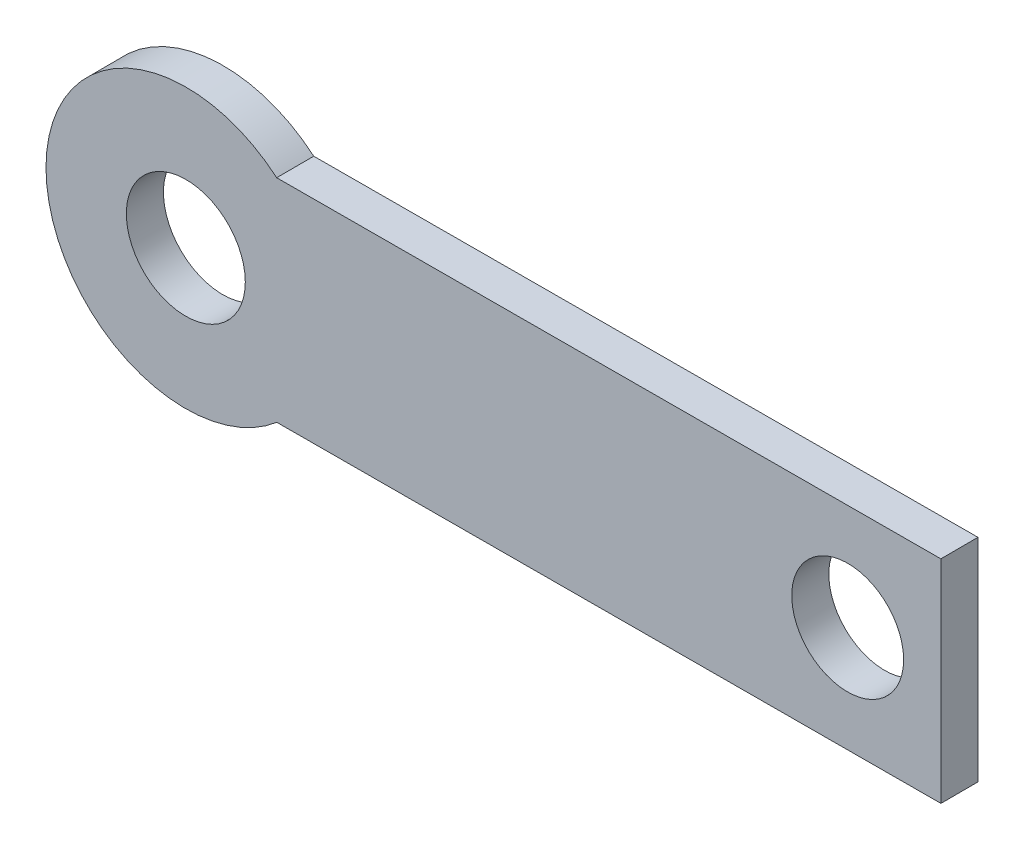
ISO-10303-21;
HEADER;
FILE_DESCRIPTION(('STEP AP214'),'2;1');
FILE_NAME('part.step','',(''),(''),'','','');
FILE_SCHEMA(('AUTOMOTIVE_DESIGN { 1 0 10303 214 1 1 1 1 }'));
ENDSEC;
DATA;
#1=APPLICATION_CONTEXT('core data for automotive mechanical design processes');
#2=APPLICATION_PROTOCOL_DEFINITION('international standard','automotive_design',2000,#1);
#3=PRODUCT_CONTEXT('',#1,'mechanical');
#4=PRODUCT('Part','Part','',(#3));
#5=PRODUCT_RELATED_PRODUCT_CATEGORY('part','',(#4));
#6=PRODUCT_DEFINITION_FORMATION('','',#4);
#7=PRODUCT_DEFINITION_CONTEXT('part definition',#1,'design');
#8=PRODUCT_DEFINITION('design','',#6,#7);
#9=PRODUCT_DEFINITION_SHAPE('','',#8);
#10=(LENGTH_UNIT() NAMED_UNIT(*) SI_UNIT(.MILLI.,.METRE.));
#11=(NAMED_UNIT(*) PLANE_ANGLE_UNIT() SI_UNIT($,.RADIAN.));
#12=(NAMED_UNIT(*) SI_UNIT($,.STERADIAN.) SOLID_ANGLE_UNIT());
#13=UNCERTAINTY_MEASURE_WITH_UNIT(LENGTH_MEASURE(1.E-05),#10,'distance_accuracy_value','');
#14=(GEOMETRIC_REPRESENTATION_CONTEXT(3) GLOBAL_UNCERTAINTY_ASSIGNED_CONTEXT((#13)) GLOBAL_UNIT_ASSIGNED_CONTEXT((#10,
#11,#12)) REPRESENTATION_CONTEXT('',''));
#15=CARTESIAN_POINT('',(0.,0.,0.));
#16=DIRECTION('',(0.,0.,1.));
#17=DIRECTION('',(1.,0.,0.));
#18=AXIS2_PLACEMENT_3D('',#15,#16,#17);
#19=CARTESIAN_POINT('',(27.1933277362902,-20.7838412208665,90.8275175081834));
#20=DIRECTION('',(-0.00308024346562612,0.000338152636767158,-0.999995198864968));
#21=DIRECTION('',(-0.999995256038301,0.,0.00308024364173475));
#22=AXIS2_PLACEMENT_3D('',#19,#20,#21);
#23=PLANE('',#22);
#24=CARTESIAN_POINT('',(27.1933277362902,-20.7838412208665,90.8275175081834));
#25=DIRECTION('',(0.00308024346562612,-0.000338152636767158,0.999995198864968));
#26=DIRECTION('',(-0.999995256038301,0.,0.00308024364173475));
#27=AXIS2_PLACEMENT_3D('',#24,#25,#26);
#28=CIRCLE('',#27,3.75);
#29=CARTESIAN_POINT('',(29.6310323230829,-17.9342704622535,90.8209723430002));
#30=VERTEX_POINT('',#29);
#31=CARTESIAN_POINT('',(29.6310323230829,-23.633406901242,90.8190451557334));
#32=VERTEX_POINT('',#31);
#33=EDGE_CURVE('E88',#30,#32,#28,.T.);
#34=ORIENTED_EDGE('',*,*,#33,.T.);
#35=DIRECTION('',(0.999995256038844,1.04159739097418E-06,-0.00308024328951546));
#36=VECTOR('',#35,1.);
#37=CARTESIAN_POINT('',(29.6310323230829,-23.633406901242,90.8190451557334));
#38=LINE('',#37,#36);
#39=CARTESIAN_POINT('',(47.4432316710768,-23.6333883480136,90.7641789879373));
#40=VERTEX_POINT('',#39);
#41=EDGE_CURVE('E83',#32,#40,#38,.T.);
#42=ORIENTED_EDGE('',*,*,#41,.T.);
#43=DIRECTION('',(0.,0.999999942825853,0.000338154240957702));
#44=VECTOR('',#43,1.);
#45=CARTESIAN_POINT('',(47.4432316710768,-23.6333883480136,90.7641789879373));
#46=LINE('',#45,#44);
#47=CARTESIAN_POINT('',(47.4432316710768,-17.9342519090251,90.7661061752041));
#48=VERTEX_POINT('',#47);
#49=EDGE_CURVE('E86',#40,#48,#46,.T.);
#50=ORIENTED_EDGE('',*,*,#49,.T.);
#51=DIRECTION('',(-0.999995256038844,-1.04159739097418E-06,0.00308024328951546));
#52=VECTOR('',#51,1.);
#53=CARTESIAN_POINT('',(47.4432316710768,-17.9342519090251,90.7661061752041));
#54=LINE('',#53,#52);
#55=EDGE_CURVE('E53',#48,#30,#54,.T.);
#56=ORIENTED_EDGE('',*,*,#55,.T.);
#57=EDGE_LOOP('',(#34,#42,#50,#56));
#58=FACE_BOUND('',#57,.T.);
#59=CARTESIAN_POINT('',(27.1933277362902,-20.7838412208665,90.8275175081834));
#60=DIRECTION('',(0.00308024346562612,-0.000338152636767158,0.999995198864968));
#61=DIRECTION('',(0.999995256038301,0.,-0.00308024364173475));
#62=AXIS2_PLACEMENT_3D('',#59,#60,#61);
#63=CIRCLE('',#62,1.595);
#64=CARTESIAN_POINT('',(28.7883201696713,-20.7838412208665,90.8226045195748));
#65=VERTEX_POINT('',#64);
#66=EDGE_CURVE('E103',#65,#65,#63,.T.);
#67=ORIENTED_EDGE('',*,*,#66,.F.);
#68=EDGE_LOOP('',(#67));
#69=FACE_BOUND('',#68,.T.);
#70=CARTESIAN_POINT('',(44.9432435309797,-20.7838227325128,90.7728431897945));
#71=DIRECTION('',(0.00308024346562612,-0.000338152636767158,0.999995198864968));
#72=DIRECTION('',(0.999995256038301,0.,-0.00308024364173475));
#73=AXIS2_PLACEMENT_3D('',#70,#71,#72);
#74=CIRCLE('',#73,1.5);
#75=CARTESIAN_POINT('',(46.4432364150371,-20.7838227325128,90.7682228243319));
#76=VERTEX_POINT('',#75);
#77=EDGE_CURVE('E118',#76,#76,#74,.T.);
#78=ORIENTED_EDGE('',*,*,#77,.F.);
#79=EDGE_LOOP('',(#78));
#80=FACE_BOUND('',#79,.T.);
#81=ADVANCED_FACE('F36',(#58,#69,#80),#23,.F.);
#82=CARTESIAN_POINT('',(27.1902474928246,-20.7835030682298,89.8275223093184));
#83=DIRECTION('',(-0.00308024346562612,0.000338152636767158,-0.999995198864968));
#84=DIRECTION('',(-0.999995256038301,0.,0.00308024364173475));
#85=AXIS2_PLACEMENT_3D('',#82,#83,#84);
#86=PLANE('',#85);
#87=CARTESIAN_POINT('',(27.1902474928246,-20.7835030682298,89.8275223093184));
#88=DIRECTION('',(0.00308024346562612,-0.000338152636767158,0.999995198864968));
#89=DIRECTION('',(0.999995256038301,0.,-0.00308024364173475));
#90=AXIS2_PLACEMENT_3D('',#87,#88,#89);
#91=CIRCLE('',#90,1.595);
#92=CARTESIAN_POINT('',(28.7852399262057,-20.7835030682298,89.8226093207099));
#93=VERTEX_POINT('',#92);
#94=EDGE_CURVE('E115',#93,#93,#91,.T.);
#95=ORIENTED_EDGE('',*,*,#94,.T.);
#96=EDGE_LOOP('',(#95));
#97=FACE_BOUND('',#96,.T.);
#98=CARTESIAN_POINT('',(27.1902474928246,-20.7835030682298,89.8275223093184));
#99=DIRECTION('',(0.00308024346562612,-0.000338152636767158,0.999995198864968));
#100=DIRECTION('',(-0.999995256038301,0.,0.00308024364173475));
#101=AXIS2_PLACEMENT_3D('',#98,#99,#100);
#102=CIRCLE('',#101,3.75);
#103=CARTESIAN_POINT('',(29.6279520796173,-17.9339323096167,89.8209771441353));
#104=VERTEX_POINT('',#103);
#105=CARTESIAN_POINT('',(29.6279520796173,-23.6330687486053,89.8190499568685));
#106=VERTEX_POINT('',#105);
#107=EDGE_CURVE('E100',#104,#106,#102,.T.);
#108=ORIENTED_EDGE('',*,*,#107,.F.);
#109=DIRECTION('',(-0.999995256038844,-1.04159739097418E-06,0.00308024328951546));
#110=VECTOR('',#109,1.);
#111=CARTESIAN_POINT('',(47.4401514276112,-17.9339137563883,89.7661109763391));
#112=LINE('',#111,#110);
#113=CARTESIAN_POINT('',(47.4401514276112,-17.9339137563883,89.7661109763391));
#114=VERTEX_POINT('',#113);
#115=EDGE_CURVE('E76',#114,#104,#112,.T.);
#116=ORIENTED_EDGE('',*,*,#115,.F.);
#117=DIRECTION('',(0.,0.999999942825853,0.000338154240957702));
#118=VECTOR('',#117,1.);
#119=CARTESIAN_POINT('',(47.4401514276112,-23.6330501953769,89.7641837890723));
#120=LINE('',#119,#118);
#121=CARTESIAN_POINT('',(47.4401514276112,-23.6330501953769,89.7641837890723));
#122=VERTEX_POINT('',#121);
#123=EDGE_CURVE('E70',#122,#114,#120,.T.);
#124=ORIENTED_EDGE('',*,*,#123,.F.);
#125=DIRECTION('',(0.999995256038844,1.04159739097418E-06,-0.00308024328951546));
#126=VECTOR('',#125,1.);
#127=CARTESIAN_POINT('',(29.6279520796173,-23.6330687486053,89.8190499568685));
#128=LINE('',#127,#126);
#129=EDGE_CURVE('E92',#106,#122,#128,.T.);
#130=ORIENTED_EDGE('',*,*,#129,.F.);
#131=EDGE_LOOP('',(#108,#116,#124,#130));
#132=FACE_BOUND('',#131,.T.);
#133=CARTESIAN_POINT('',(44.9401632875141,-20.7834845798761,89.7728479909295));
#134=DIRECTION('',(0.00308024346562612,-0.000338152636767158,0.999995198864968));
#135=DIRECTION('',(0.999995256038301,0.,-0.00308024364173475));
#136=AXIS2_PLACEMENT_3D('',#133,#134,#135);
#137=CIRCLE('',#136,1.5);
#138=CARTESIAN_POINT('',(46.4401561715715,-20.7834845798761,89.7682276254669));
#139=VERTEX_POINT('',#138);
#140=EDGE_CURVE('E121',#139,#139,#137,.T.);
#141=ORIENTED_EDGE('',*,*,#140,.T.);
#142=EDGE_LOOP('',(#141));
#143=FACE_BOUND('',#142,.T.);
#144=ADVANCED_FACE('F111',(#97,#132,#143),#86,.T.);
#145=CARTESIAN_POINT('',(27.1933277362902,-20.7838412208665,90.8275175081834));
#146=DIRECTION('',(-0.00308024346562612,0.000338152636767158,-0.999995198864968));
#147=DIRECTION('',(-0.999995256038301,0.,0.00308024364173475));
#148=AXIS2_PLACEMENT_3D('',#145,#146,#147);
#149=CYLINDRICAL_SURFACE('',#148,3.75);
#150=ORIENTED_EDGE('',*,*,#107,.T.);
#151=DIRECTION('',(-0.00308024346562612,0.000338152636767158,-0.999995198864968));
#152=VECTOR('',#151,1.);
#153=CARTESIAN_POINT('',(29.6310323230829,-23.633406901242,90.8190451557334));
#154=LINE('',#153,#152);
#155=EDGE_CURVE('E11',#32,#106,#154,.T.);
#156=ORIENTED_EDGE('',*,*,#155,.F.);
#157=ORIENTED_EDGE('',*,*,#33,.F.);
#158=DIRECTION('',(-0.00308024346562612,0.000338152636767158,-0.999995198864968));
#159=VECTOR('',#158,1.);
#160=CARTESIAN_POINT('',(29.6310323230829,-17.9342704622535,90.8209723430002));
#161=LINE('',#160,#159);
#162=EDGE_CURVE('E96',#30,#104,#161,.T.);
#163=ORIENTED_EDGE('',*,*,#162,.T.);
#164=EDGE_LOOP('',(#150,#156,#157,#163));
#165=FACE_BOUND('',#164,.T.);
#166=ADVANCED_FACE('F38',(#165),#149,.T.);
#167=CARTESIAN_POINT('',(29.6310323230829,-23.633406901242,90.8190451557334));
#168=DIRECTION('',(0.,0.999999942825853,0.000338154240957742));
#169=DIRECTION('',(0.,-0.000338154240957742,0.999999942825853));
#170=AXIS2_PLACEMENT_3D('',#167,#168,#169);
#171=PLANE('',#170);
#172=ORIENTED_EDGE('',*,*,#129,.T.);
#173=DIRECTION('',(-0.00308024346562612,0.000338152636767158,-0.999995198864968));
#174=VECTOR('',#173,1.);
#175=CARTESIAN_POINT('',(47.4432316710768,-23.6333883480136,90.7641789879373));
#176=LINE('',#175,#174);
#177=EDGE_CURVE('E45',#40,#122,#176,.T.);
#178=ORIENTED_EDGE('',*,*,#177,.F.);
#179=ORIENTED_EDGE('',*,*,#41,.F.);
#180=ORIENTED_EDGE('',*,*,#155,.T.);
#181=EDGE_LOOP('',(#172,#178,#179,#180));
#182=FACE_BOUND('',#181,.T.);
#183=ADVANCED_FACE('F91',(#182),#171,.F.);
#184=CARTESIAN_POINT('',(47.4432316710768,-23.6333883480136,90.7641789879373));
#185=DIRECTION('',(-0.999995256038844,-1.04159739108372E-06,0.00308024328951582));
#186=DIRECTION('',(0.00308024328951749,0.,0.999995256039386));
#187=AXIS2_PLACEMENT_3D('',#184,#185,#186);
#188=PLANE('',#187);
#189=ORIENTED_EDGE('',*,*,#123,.T.);
#190=DIRECTION('',(-0.00308024346562612,0.000338152636767158,-0.999995198864968));
#191=VECTOR('',#190,1.);
#192=CARTESIAN_POINT('',(47.4432316710768,-17.9342519090251,90.7661061752041));
#193=LINE('',#192,#191);
#194=EDGE_CURVE('E93',#48,#114,#193,.T.);
#195=ORIENTED_EDGE('',*,*,#194,.F.);
#196=ORIENTED_EDGE('',*,*,#49,.F.);
#197=ORIENTED_EDGE('',*,*,#177,.T.);
#198=EDGE_LOOP('',(#189,#195,#196,#197));
#199=FACE_BOUND('',#198,.T.);
#200=ADVANCED_FACE('F94',(#199),#188,.F.);
#201=CARTESIAN_POINT('',(47.4432316710768,-17.9342519090251,90.7661061752041));
#202=DIRECTION('',(0.,-0.999999942825853,-0.000338154240957742));
#203=DIRECTION('',(0.,0.000338154240957742,-0.999999942825853));
#204=AXIS2_PLACEMENT_3D('',#201,#202,#203);
#205=PLANE('',#204);
#206=ORIENTED_EDGE('',*,*,#115,.T.);
#207=ORIENTED_EDGE('',*,*,#162,.F.);
#208=ORIENTED_EDGE('',*,*,#55,.F.);
#209=ORIENTED_EDGE('',*,*,#194,.T.);
#210=EDGE_LOOP('',(#206,#207,#208,#209));
#211=FACE_BOUND('',#210,.T.);
#212=ADVANCED_FACE('F108',(#211),#205,.F.);
#213=CARTESIAN_POINT('',(27.1933277362902,-20.7838412208665,90.8275175081834));
#214=DIRECTION('',(-0.00308024346562612,0.000338152636767158,-0.999995198864968));
#215=DIRECTION('',(-0.999995256038301,0.,0.00308024364173475));
#216=AXIS2_PLACEMENT_3D('',#213,#214,#215);
#217=CYLINDRICAL_SURFACE('',#216,1.595);
#218=ORIENTED_EDGE('',*,*,#66,.T.);
#219=EDGE_LOOP('',(#218));
#220=FACE_BOUND('',#219,.T.);
#221=ORIENTED_EDGE('',*,*,#94,.F.);
#222=EDGE_LOOP('',(#221));
#223=FACE_BOUND('',#222,.T.);
#224=ADVANCED_FACE('F138',(#220,#223),#217,.F.);
#225=CARTESIAN_POINT('',(44.9432435309797,-20.7838227325128,90.7728431897945));
#226=DIRECTION('',(-0.00308024346562612,0.000338152636767158,-0.999995198864968));
#227=DIRECTION('',(-0.999995256038301,0.,0.00308024364173475));
#228=AXIS2_PLACEMENT_3D('',#225,#226,#227);
#229=CYLINDRICAL_SURFACE('',#228,1.5);
#230=ORIENTED_EDGE('',*,*,#77,.T.);
#231=EDGE_LOOP('',(#230));
#232=FACE_BOUND('',#231,.T.);
#233=ORIENTED_EDGE('',*,*,#140,.F.);
#234=EDGE_LOOP('',(#233));
#235=FACE_BOUND('',#234,.T.);
#236=ADVANCED_FACE('F127',(#232,#235),#229,.F.);
#237=CLOSED_SHELL('',(#81,#144,#166,#183,#200,#212,#224,#236));
#238=MANIFOLD_SOLID_BREP('B2',#237);
#239=ADVANCED_BREP_SHAPE_REPRESENTATION('',(#18,#238),#14);
#240=SHAPE_DEFINITION_REPRESENTATION(#9,#239);
ENDSEC;
END-ISO-10303-21;
